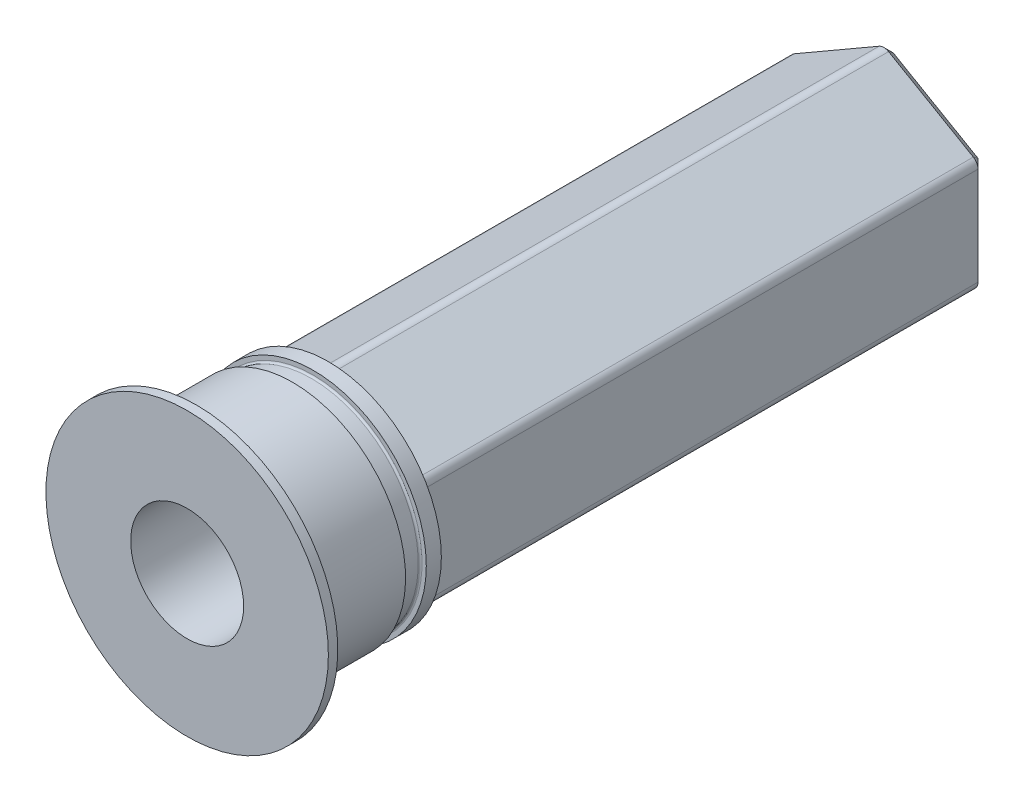
ISO-10303-21;
HEADER;
FILE_DESCRIPTION(('STEP AP214'),'2;1');
FILE_NAME('part.step','',(''),(''),'','','');
FILE_SCHEMA(('AUTOMOTIVE_DESIGN { 1 0 10303 214 1 1 1 1 }'));
ENDSEC;
DATA;
#1=APPLICATION_CONTEXT('core data for automotive mechanical design processes');
#2=APPLICATION_PROTOCOL_DEFINITION('international standard','automotive_design',2000,#1);
#3=PRODUCT_CONTEXT('',#1,'mechanical');
#4=PRODUCT('Part','Part','',(#3));
#5=PRODUCT_RELATED_PRODUCT_CATEGORY('part','',(#4));
#6=PRODUCT_DEFINITION_FORMATION('','',#4);
#7=PRODUCT_DEFINITION_CONTEXT('part definition',#1,'design');
#8=PRODUCT_DEFINITION('design','',#6,#7);
#9=PRODUCT_DEFINITION_SHAPE('','',#8);
#10=(LENGTH_UNIT() NAMED_UNIT(*) SI_UNIT(.MILLI.,.METRE.));
#11=(NAMED_UNIT(*) PLANE_ANGLE_UNIT() SI_UNIT($,.RADIAN.));
#12=(NAMED_UNIT(*) SI_UNIT($,.STERADIAN.) SOLID_ANGLE_UNIT());
#13=UNCERTAINTY_MEASURE_WITH_UNIT(LENGTH_MEASURE(1.E-05),#10,'distance_accuracy_value','');
#14=(GEOMETRIC_REPRESENTATION_CONTEXT(3) GLOBAL_UNCERTAINTY_ASSIGNED_CONTEXT((#13)) GLOBAL_UNIT_ASSIGNED_CONTEXT((#10,
#11,#12)) REPRESENTATION_CONTEXT('',''));
#15=CARTESIAN_POINT('',(0.,0.,0.));
#16=DIRECTION('',(0.,0.,1.));
#17=DIRECTION('',(1.,0.,0.));
#18=AXIS2_PLACEMENT_3D('',#15,#16,#17);
#19=CARTESIAN_POINT('',(0.,0.,-46.5));
#20=DIRECTION('',(0.,0.,1.));
#21=DIRECTION('',(1.,0.,0.));
#22=AXIS2_PLACEMENT_3D('',#19,#20,#21);
#23=CYLINDRICAL_SURFACE('',#22,3.);
#24=CARTESIAN_POINT('',(0.,0.,-46.5));
#25=DIRECTION('',(0.,0.,1.));
#26=DIRECTION('',(1.,0.,0.));
#27=AXIS2_PLACEMENT_3D('',#24,#25,#26);
#28=CIRCLE('',#27,3.);
#29=CARTESIAN_POINT('',(3.,0.,-46.5));
#30=VERTEX_POINT('',#29);
#31=EDGE_CURVE('E158',#30,#30,#28,.T.);
#32=CARTESIAN_POINT('',(0.,0.,-9.));
#33=DIRECTION('',(0.,0.,1.));
#34=DIRECTION('',(1.,0.,0.));
#35=AXIS2_PLACEMENT_3D('',#32,#33,#34);
#36=CIRCLE('',#35,3.);
#37=CARTESIAN_POINT('',(3.,0.,-9.));
#38=VERTEX_POINT('',#37);
#39=EDGE_CURVE('E497',#38,#38,#36,.F.);
#40=CARTESIAN_POINT('',(3.,0.,-46.5));
#41=CARTESIAN_POINT('',(3.,0.,-46.109375));
#42=CARTESIAN_POINT('',(3.,0.,-45.71875));
#43=CARTESIAN_POINT('',(3.,0.,-44.9375));
#44=CARTESIAN_POINT('',(3.,0.,-44.546875));
#45=CARTESIAN_POINT('',(3.,0.,-43.765625));
#46=CARTESIAN_POINT('',(3.,0.,-43.375));
#47=CARTESIAN_POINT('',(3.,0.,-42.59375));
#48=CARTESIAN_POINT('',(3.,0.,-42.203125));
#49=CARTESIAN_POINT('',(3.,0.,-41.421875));
#50=CARTESIAN_POINT('',(3.,0.,-41.03125));
#51=CARTESIAN_POINT('',(3.,0.,-40.25));
#52=CARTESIAN_POINT('',(3.,0.,-39.859375));
#53=CARTESIAN_POINT('',(3.,0.,-39.078125));
#54=CARTESIAN_POINT('',(3.,0.,-38.6875));
#55=CARTESIAN_POINT('',(3.,0.,-37.90625));
#56=CARTESIAN_POINT('',(3.,0.,-37.515625));
#57=CARTESIAN_POINT('',(3.,0.,-36.734375));
#58=CARTESIAN_POINT('',(3.,0.,-36.34375));
#59=CARTESIAN_POINT('',(3.,0.,-35.5625));
#60=CARTESIAN_POINT('',(3.,0.,-35.171875));
#61=CARTESIAN_POINT('',(3.,0.,-34.390625));
#62=CARTESIAN_POINT('',(3.,0.,-34.));
#63=CARTESIAN_POINT('',(3.,0.,-33.21875));
#64=CARTESIAN_POINT('',(3.,0.,-32.828125));
#65=CARTESIAN_POINT('',(3.,0.,-32.046875));
#66=CARTESIAN_POINT('',(3.,0.,-31.65625));
#67=CARTESIAN_POINT('',(3.,0.,-30.875));
#68=CARTESIAN_POINT('',(3.,0.,-30.484375));
#69=CARTESIAN_POINT('',(3.,0.,-29.703125));
#70=CARTESIAN_POINT('',(3.,0.,-29.3125));
#71=CARTESIAN_POINT('',(3.,0.,-28.53125));
#72=CARTESIAN_POINT('',(3.,0.,-28.140625));
#73=CARTESIAN_POINT('',(3.,0.,-27.359375));
#74=CARTESIAN_POINT('',(3.,0.,-26.96875));
#75=CARTESIAN_POINT('',(3.,0.,-26.1875));
#76=CARTESIAN_POINT('',(3.,0.,-25.796875));
#77=CARTESIAN_POINT('',(3.,0.,-25.015625));
#78=CARTESIAN_POINT('',(3.,0.,-24.625));
#79=CARTESIAN_POINT('',(3.,0.,-23.84375));
#80=CARTESIAN_POINT('',(3.,0.,-23.453125));
#81=CARTESIAN_POINT('',(3.,0.,-22.671875));
#82=CARTESIAN_POINT('',(3.,0.,-22.28125));
#83=CARTESIAN_POINT('',(3.,0.,-21.5));
#84=CARTESIAN_POINT('',(3.,0.,-21.109375));
#85=CARTESIAN_POINT('',(3.,0.,-20.328125));
#86=CARTESIAN_POINT('',(3.,0.,-19.9375));
#87=CARTESIAN_POINT('',(3.,0.,-19.15625));
#88=CARTESIAN_POINT('',(3.,0.,-18.765625));
#89=CARTESIAN_POINT('',(3.,0.,-17.984375));
#90=CARTESIAN_POINT('',(3.,0.,-17.59375));
#91=CARTESIAN_POINT('',(3.,0.,-16.8125));
#92=CARTESIAN_POINT('',(3.,0.,-16.421875));
#93=CARTESIAN_POINT('',(3.,0.,-15.640625));
#94=CARTESIAN_POINT('',(3.,0.,-15.25));
#95=CARTESIAN_POINT('',(3.,0.,-14.46875));
#96=CARTESIAN_POINT('',(3.,0.,-14.078125));
#97=CARTESIAN_POINT('',(3.,0.,-13.296875));
#98=CARTESIAN_POINT('',(3.,0.,-12.90625));
#99=CARTESIAN_POINT('',(3.,0.,-12.125));
#100=CARTESIAN_POINT('',(3.,0.,-11.734375));
#101=CARTESIAN_POINT('',(3.,0.,-10.953125));
#102=CARTESIAN_POINT('',(3.,0.,-10.5625));
#103=CARTESIAN_POINT('',(3.,0.,-9.78125));
#104=CARTESIAN_POINT('',(3.,0.,-9.390625));
#105=CARTESIAN_POINT('',(3.,0.,-9.));
#106=B_SPLINE_CURVE_WITH_KNOTS('',3,(#40,#41,#42,#43,#44,#45,#46,#47,#48,#49,#50,#51,#52,#53,
#54,#55,#56,#57,#58,#59,#60,#61,#62,#63,#64,#65,#66,#67,#68,#69,#70,#71,#72,#73,#74,#75,#76,#77,
#78,#79,#80,#81,#82,#83,#84,#85,#86,#87,#88,#89,#90,#91,#92,#93,#94,#95,#96,#97,#98,#99,#100,
#101,#102,#103,#104,#105),.UNSPECIFIED.,.F.,.F.,(4,2,2,2,2,2,2,2,2,2,2,2,2,2,2,2,2,2,2,2,2,2,2,
2,2,2,2,2,2,2,2,2,4),(0.,1.171875,2.34375,3.51562499999999,4.6875,5.859375,7.03125,8.203125,
9.37499999999999,10.546875,11.71875,12.890625,14.0625,15.234375,16.40625,17.578125,18.75,
19.921875,21.09375,22.265625,23.4375,24.609375,25.78125,26.953125,28.125,29.296875,30.46875,
31.640625,32.8125,33.984375,35.15625,36.328125,37.5),.UNSPECIFIED.);
#107=EDGE_CURVE('BSEAM42',#30,#38,#106,.T.);
#108=ORIENTED_EDGE('',*,*,#31,.F.);
#109=ORIENTED_EDGE('',*,*,#39,.F.);
#110=ORIENTED_EDGE('',*,*,#107,.T.);
#111=ORIENTED_EDGE('',*,*,#107,.F.);
#112=EDGE_LOOP('',(#108,#110,#109,#111));
#113=FACE_BOUND('',#112,.T.);
#114=ADVANCED_FACE('F42',(#113),#23,.F.);
#115=CARTESIAN_POINT('',(0.,0.,-8.5));
#116=DIRECTION('',(0.,0.,-1.));
#117=DIRECTION('',(0.,1.,0.));
#118=AXIS2_PLACEMENT_3D('',#115,#116,#117);
#119=CYLINDRICAL_SURFACE('',#118,7.5);
#120=CARTESIAN_POINT('',(0.,0.,-9.5));
#121=DIRECTION('',(0.,0.,-1.));
#122=DIRECTION('',(0.,1.,0.));
#123=AXIS2_PLACEMENT_3D('',#120,#121,#122);
#124=CIRCLE('',#123,7.5);
#125=CARTESIAN_POINT('',(0.,7.5,-9.5));
#126=VERTEX_POINT('',#125);
#127=EDGE_CURVE('E424',#126,#126,#124,.T.);
#128=ORIENTED_EDGE('',*,*,#127,.F.);
#129=EDGE_LOOP('',(#128));
#130=FACE_BOUND('',#129,.T.);
#131=CARTESIAN_POINT('',(0.,0.,-9.));
#132=DIRECTION('',(0.,0.,1.));
#133=DIRECTION('',(1.,0.,0.));
#134=AXIS2_PLACEMENT_3D('',#131,#132,#133);
#135=CIRCLE('',#134,7.5);
#136=CARTESIAN_POINT('',(7.5,0.,-9.));
#137=VERTEX_POINT('',#136);
#138=EDGE_CURVE('E46',#137,#137,#135,.F.);
#139=ORIENTED_EDGE('',*,*,#138,.T.);
#140=EDGE_LOOP('',(#139));
#141=FACE_BOUND('',#140,.T.);
#142=ADVANCED_FACE('F281',(#130,#141),#119,.T.);
#143=CARTESIAN_POINT('',(0.,0.,21.198484809835));
#144=DIRECTION('',(0.,0.,-1.));
#145=DIRECTION('',(0.,1.,0.));
#146=AXIS2_PLACEMENT_3D('',#143,#144,#145);
#147=CYLINDRICAL_SURFACE('',#146,6.);
#148=CARTESIAN_POINT('',(0.,0.,-9.8));
#149=DIRECTION('',(0.,0.,1.));
#150=DIRECTION('',(1.,0.,0.));
#151=AXIS2_PLACEMENT_3D('',#148,#149,#150);
#152=CIRCLE('',#151,6.);
#153=CARTESIAN_POINT('',(6.,0.,-9.8));
#154=VERTEX_POINT('',#153);
#155=EDGE_CURVE('E51',#154,#154,#152,.F.);
#156=ORIENTED_EDGE('',*,*,#155,.T.);
#157=EDGE_LOOP('',(#156));
#158=FACE_BOUND('',#157,.T.);
#159=CARTESIAN_POINT('',(0.,0.,-14.6));
#160=DIRECTION('',(0.,0.,-1.));
#161=DIRECTION('',(0.,1.,0.));
#162=AXIS2_PLACEMENT_3D('',#159,#160,#161);
#163=CIRCLE('',#162,6.);
#164=CARTESIAN_POINT('',(0.,6.,-14.6));
#165=VERTEX_POINT('',#164);
#166=EDGE_CURVE('E221',#165,#165,#163,.F.);
#167=ORIENTED_EDGE('',*,*,#166,.T.);
#168=EDGE_LOOP('',(#167));
#169=FACE_BOUND('',#168,.T.);
#170=ADVANCED_FACE('F263',(#158,#169),#147,.T.);
#171=CARTESIAN_POINT('',(0.,0.,-16.5));
#172=DIRECTION('',(0.,0.,1.));
#173=DIRECTION('',(1.,0.,0.));
#174=AXIS2_PLACEMENT_3D('',#171,#172,#173);
#175=CIRCLE('',#174,6.);
#176=CARTESIAN_POINT('',(6.,0.,-16.5));
#177=VERTEX_POINT('',#176);
#178=EDGE_CURVE('E418',#177,#177,#175,.F.);
#179=ORIENTED_EDGE('',*,*,#178,.F.);
#180=EDGE_LOOP('',(#179));
#181=FACE_BOUND('',#180,.T.);
#182=CARTESIAN_POINT('',(0.,0.,-15.7));
#183=DIRECTION('',(0.,0.,1.));
#184=DIRECTION('',(0.,-1.,0.));
#185=AXIS2_PLACEMENT_3D('',#182,#183,#184);
#186=CIRCLE('',#185,6.);
#187=CARTESIAN_POINT('',(0.,-6.,-15.7));
#188=VERTEX_POINT('',#187);
#189=EDGE_CURVE('E254',#188,#188,#186,.F.);
#190=ORIENTED_EDGE('',*,*,#189,.T.);
#191=EDGE_LOOP('',(#190));
#192=FACE_BOUND('',#191,.T.);
#193=ADVANCED_FACE('F298',(#181,#192),#147,.T.);
#194=CARTESIAN_POINT('',(0.,0.,-46.5));
#195=DIRECTION('',(0.,0.,1.));
#196=DIRECTION('',(1.,0.,0.));
#197=AXIS2_PLACEMENT_3D('',#194,#195,#196);
#198=PLANE('',#197);
#199=DIRECTION('',(-0.866025403784439,0.5,0.));
#200=VECTOR('',#199,1.);
#201=CARTESIAN_POINT('',(-4.50000000000001,-2.59807621135333,-46.5));
#202=LINE('',#201,#200);
#203=CARTESIAN_POINT('',(0.,-5.19615242270664,-46.5));
#204=VERTEX_POINT('',#203);
#205=CARTESIAN_POINT('',(-4.50000000000001,-2.59807621135333,-46.5));
#206=VERTEX_POINT('',#205);
#207=EDGE_CURVE('E176',#204,#206,#202,.T.);
#208=ORIENTED_EDGE('',*,*,#207,.T.);
#209=DIRECTION('',(0.,1.,0.));
#210=VECTOR('',#209,1.);
#211=CARTESIAN_POINT('',(-4.5,2.59807621135332,-46.5));
#212=LINE('',#211,#210);
#213=CARTESIAN_POINT('',(-4.5,2.59807621135331,-46.5));
#214=VERTEX_POINT('',#213);
#215=EDGE_CURVE('E192',#206,#214,#212,.T.);
#216=ORIENTED_EDGE('',*,*,#215,.T.);
#217=DIRECTION('',(0.866025403784439,0.5,0.));
#218=VECTOR('',#217,1.);
#219=CARTESIAN_POINT('',(0.,5.19615242270663,-46.5));
#220=LINE('',#219,#218);
#221=CARTESIAN_POINT('',(0.,5.19615242270662,-46.5));
#222=VERTEX_POINT('',#221);
#223=EDGE_CURVE('E190',#214,#222,#220,.T.);
#224=ORIENTED_EDGE('',*,*,#223,.T.);
#225=DIRECTION('',(0.866025403784439,-0.5,0.));
#226=VECTOR('',#225,1.);
#227=CARTESIAN_POINT('',(4.49999999999999,2.59807621135331,-46.5));
#228=LINE('',#227,#226);
#229=CARTESIAN_POINT('',(4.5,2.59807621135332,-46.5));
#230=VERTEX_POINT('',#229);
#231=EDGE_CURVE('E188',#222,#230,#228,.T.);
#232=ORIENTED_EDGE('',*,*,#231,.T.);
#233=DIRECTION('',(0.,-1.,0.));
#234=VECTOR('',#233,1.);
#235=CARTESIAN_POINT('',(4.5,-2.59807621135332,-46.5));
#236=LINE('',#235,#234);
#237=CARTESIAN_POINT('',(4.5,-2.59807621135331,-46.5));
#238=VERTEX_POINT('',#237);
#239=EDGE_CURVE('E186',#230,#238,#236,.T.);
#240=ORIENTED_EDGE('',*,*,#239,.T.);
#241=DIRECTION('',(-0.866025403784439,-0.5,0.));
#242=VECTOR('',#241,1.);
#243=CARTESIAN_POINT('',(0.,-5.19615242270663,-46.5));
#244=LINE('',#243,#242);
#245=EDGE_CURVE('E179',#238,#204,#244,.T.);
#246=ORIENTED_EDGE('',*,*,#245,.T.);
#247=EDGE_LOOP('',(#208,#216,#224,#232,#240,#246));
#248=FACE_BOUND('',#247,.T.);
#249=ORIENTED_EDGE('',*,*,#31,.T.);
#250=EDGE_LOOP('',(#249));
#251=FACE_BOUND('',#250,.T.);
#252=ADVANCED_FACE('F295',(#248,#251),#198,.F.);
#253=CARTESIAN_POINT('',(0.,0.,-9.5));
#254=DIRECTION('',(0.,0.,1.));
#255=DIRECTION('',(1.,0.,0.));
#256=AXIS2_PLACEMENT_3D('',#253,#254,#255);
#257=PLANE('',#256);
#258=CARTESIAN_POINT('',(0.,0.,-9.5));
#259=DIRECTION('',(0.,0.,1.));
#260=DIRECTION('',(1.,0.,0.));
#261=AXIS2_PLACEMENT_3D('',#258,#259,#260);
#262=CIRCLE('',#261,6.3);
#263=CARTESIAN_POINT('',(6.3,0.,-9.5));
#264=VERTEX_POINT('',#263);
#265=EDGE_CURVE('E13',#264,#264,#262,.T.);
#266=ORIENTED_EDGE('',*,*,#265,.T.);
#267=EDGE_LOOP('',(#266));
#268=FACE_BOUND('',#267,.T.);
#269=ORIENTED_EDGE('',*,*,#127,.T.);
#270=EDGE_LOOP('',(#269));
#271=FACE_BOUND('',#270,.T.);
#272=ADVANCED_FACE('F293',(#268,#271),#257,.F.);
#273=CARTESIAN_POINT('',(5.,-2.88675134594812,22.5141171956319));
#274=DIRECTION('',(0.5,-0.866025403784439,0.));
#275=DIRECTION('',(0.866025403784439,0.5,0.));
#276=AXIS2_PLACEMENT_3D('',#273,#274,#275);
#277=PLANE('',#276);
#278=DIRECTION('',(0.,0.,-1.));
#279=VECTOR('',#278,1.);
#280=CARTESIAN_POINT('',(0.25,-5.62916512459885,22.5141171956319));
#281=LINE('',#280,#279);
#282=CARTESIAN_POINT('',(0.249999999999999,-5.62916512459885,-16.5));
#283=VERTEX_POINT('',#282);
#284=CARTESIAN_POINT('',(0.25,-5.62916512459885,-46.));
#285=VERTEX_POINT('',#284);
#286=EDGE_CURVE('E175',#283,#285,#281,.T.);
#287=ORIENTED_EDGE('',*,*,#286,.T.);
#288=DIRECTION('',(0.866025403784439,0.5,0.));
#289=VECTOR('',#288,1.);
#290=CARTESIAN_POINT('',(4.75,-3.03108891324554,-46.));
#291=LINE('',#290,#289);
#292=CARTESIAN_POINT('',(4.75,-3.03108891324554,-46.));
#293=VERTEX_POINT('',#292);
#294=EDGE_CURVE('E204',#285,#293,#291,.T.);
#295=ORIENTED_EDGE('',*,*,#294,.T.);
#296=DIRECTION('',(0.,0.,-1.));
#297=VECTOR('',#296,1.);
#298=CARTESIAN_POINT('',(4.75,-3.03108891324553,22.5141171956319));
#299=LINE('',#298,#297);
#300=CARTESIAN_POINT('',(4.75,-3.03108891324553,-16.5));
#301=VERTEX_POINT('',#300);
#302=EDGE_CURVE('E402',#293,#301,#299,.F.);
#303=ORIENTED_EDGE('',*,*,#302,.T.);
#304=DIRECTION('',(-0.866025403784439,-0.5,0.));
#305=VECTOR('',#304,1.);
#306=CARTESIAN_POINT('',(5.,-2.88675134594813,-16.5));
#307=LINE('',#306,#305);
#308=EDGE_CURVE('E170',#301,#283,#307,.T.);
#309=ORIENTED_EDGE('',*,*,#308,.T.);
#310=EDGE_LOOP('',(#287,#295,#303,#309));
#311=FACE_BOUND('',#310,.T.);
#312=ADVANCED_FACE('F463',(#311),#277,.T.);
#313=CARTESIAN_POINT('',(5.,2.88675134594813,22.5141171956319));
#314=DIRECTION('',(1.,0.,0.));
#315=DIRECTION('',(0.,1.,0.));
#316=AXIS2_PLACEMENT_3D('',#313,#314,#315);
#317=PLANE('',#316);
#318=DIRECTION('',(0.,0.,-1.));
#319=VECTOR('',#318,1.);
#320=CARTESIAN_POINT('',(5.,-2.59807621135331,22.5141171956319));
#321=LINE('',#320,#319);
#322=CARTESIAN_POINT('',(5.,-2.59807621135331,-16.5));
#323=VERTEX_POINT('',#322);
#324=CARTESIAN_POINT('',(5.,-2.59807621135332,-46.));
#325=VERTEX_POINT('',#324);
#326=EDGE_CURVE('E392',#323,#325,#321,.T.);
#327=ORIENTED_EDGE('',*,*,#326,.T.);
#328=DIRECTION('',(0.,1.,0.));
#329=VECTOR('',#328,1.);
#330=CARTESIAN_POINT('',(5.,2.59807621135332,-46.));
#331=LINE('',#330,#329);
#332=CARTESIAN_POINT('',(5.,2.59807621135332,-46.));
#333=VERTEX_POINT('',#332);
#334=EDGE_CURVE('E202',#325,#333,#331,.T.);
#335=ORIENTED_EDGE('',*,*,#334,.T.);
#336=DIRECTION('',(0.,0.,-1.));
#337=VECTOR('',#336,1.);
#338=CARTESIAN_POINT('',(5.,2.59807621135332,22.5141171956319));
#339=LINE('',#338,#337);
#340=CARTESIAN_POINT('',(5.,2.59807621135332,-16.5));
#341=VERTEX_POINT('',#340);
#342=EDGE_CURVE('E382',#333,#341,#339,.F.);
#343=ORIENTED_EDGE('',*,*,#342,.T.);
#344=DIRECTION('',(0.,-1.,0.));
#345=VECTOR('',#344,1.);
#346=CARTESIAN_POINT('',(5.,2.88675134594813,-16.5));
#347=LINE('',#346,#345);
#348=EDGE_CURVE('E253',#341,#323,#347,.T.);
#349=ORIENTED_EDGE('',*,*,#348,.T.);
#350=EDGE_LOOP('',(#327,#335,#343,#349));
#351=FACE_BOUND('',#350,.T.);
#352=ADVANCED_FACE('F468',(#351),#317,.T.);
#353=CARTESIAN_POINT('',(0.,5.77350269189626,22.5141171956319));
#354=DIRECTION('',(0.5,0.866025403784439,0.));
#355=DIRECTION('',(-0.866025403784439,0.5,0.));
#356=AXIS2_PLACEMENT_3D('',#353,#354,#355);
#357=PLANE('',#356);
#358=DIRECTION('',(0.,0.,-1.));
#359=VECTOR('',#358,1.);
#360=CARTESIAN_POINT('',(4.75,3.03108891324554,22.5141171956319));
#361=LINE('',#360,#359);
#362=CARTESIAN_POINT('',(4.75,3.03108891324554,-16.5));
#363=VERTEX_POINT('',#362);
#364=CARTESIAN_POINT('',(4.75,3.03108891324554,-46.));
#365=VERTEX_POINT('',#364);
#366=EDGE_CURVE('E381',#363,#365,#361,.T.);
#367=ORIENTED_EDGE('',*,*,#366,.T.);
#368=DIRECTION('',(-0.866025403784439,0.5,0.));
#369=VECTOR('',#368,1.);
#370=CARTESIAN_POINT('',(0.250000000000001,5.62916512459885,-46.));
#371=LINE('',#370,#369);
#372=CARTESIAN_POINT('',(0.250000000000001,5.62916512459885,-46.));
#373=VERTEX_POINT('',#372);
#374=EDGE_CURVE('E200',#365,#373,#371,.T.);
#375=ORIENTED_EDGE('',*,*,#374,.T.);
#376=DIRECTION('',(0.,0.,-1.));
#377=VECTOR('',#376,1.);
#378=CARTESIAN_POINT('',(0.250000000000001,5.62916512459886,22.5141171956319));
#379=LINE('',#378,#377);
#380=CARTESIAN_POINT('',(0.250000000000001,5.62916512459885,-16.5));
#381=VERTEX_POINT('',#380);
#382=EDGE_CURVE('E389',#373,#381,#379,.F.);
#383=ORIENTED_EDGE('',*,*,#382,.T.);
#384=DIRECTION('',(0.866025403784439,-0.5,0.));
#385=VECTOR('',#384,1.);
#386=CARTESIAN_POINT('',(0.,5.77350269189626,-16.5));
#387=LINE('',#386,#385);
#388=EDGE_CURVE('E388',#381,#363,#387,.T.);
#389=ORIENTED_EDGE('',*,*,#388,.T.);
#390=EDGE_LOOP('',(#367,#375,#383,#389));
#391=FACE_BOUND('',#390,.T.);
#392=ADVANCED_FACE('F385',(#391),#357,.T.);
#393=CARTESIAN_POINT('',(-5.,2.88675134594813,22.5141171956319));
#394=DIRECTION('',(-0.5,0.866025403784439,0.));
#395=DIRECTION('',(-0.866025403784438,-0.5,0.));
#396=AXIS2_PLACEMENT_3D('',#393,#394,#395);
#397=PLANE('',#396);
#398=DIRECTION('',(0.,0.,-1.));
#399=VECTOR('',#398,1.);
#400=CARTESIAN_POINT('',(-0.249999999999999,5.62916512459886,22.5141171956319));
#401=LINE('',#400,#399);
#402=CARTESIAN_POINT('',(-0.250000000000001,5.62916512459885,-16.5));
#403=VERTEX_POINT('',#402);
#404=CARTESIAN_POINT('',(-0.249999999999999,5.62916512459885,-46.));
#405=VERTEX_POINT('',#404);
#406=EDGE_CURVE('E394',#403,#405,#401,.T.);
#407=ORIENTED_EDGE('',*,*,#406,.T.);
#408=DIRECTION('',(-0.866025403784438,-0.5,0.));
#409=VECTOR('',#408,1.);
#410=CARTESIAN_POINT('',(-4.75,3.03108891324553,-46.));
#411=LINE('',#410,#409);
#412=CARTESIAN_POINT('',(-4.75,3.03108891324553,-46.));
#413=VERTEX_POINT('',#412);
#414=EDGE_CURVE('E198',#405,#413,#411,.T.);
#415=ORIENTED_EDGE('',*,*,#414,.T.);
#416=DIRECTION('',(0.,0.,-1.));
#417=VECTOR('',#416,1.);
#418=CARTESIAN_POINT('',(-4.75,3.03108891324554,22.5141171956319));
#419=LINE('',#418,#417);
#420=CARTESIAN_POINT('',(-4.75,3.03108891324554,-16.5));
#421=VERTEX_POINT('',#420);
#422=EDGE_CURVE('E390',#413,#421,#419,.F.);
#423=ORIENTED_EDGE('',*,*,#422,.T.);
#424=DIRECTION('',(0.866025403784438,0.5,0.));
#425=VECTOR('',#424,1.);
#426=CARTESIAN_POINT('',(-5.,2.88675134594813,-16.5));
#427=LINE('',#426,#425);
#428=EDGE_CURVE('E419',#421,#403,#427,.T.);
#429=ORIENTED_EDGE('',*,*,#428,.T.);
#430=EDGE_LOOP('',(#407,#415,#423,#429));
#431=FACE_BOUND('',#430,.T.);
#432=ADVANCED_FACE('F440',(#431),#397,.T.);
#433=CARTESIAN_POINT('',(-5.,-2.88675134594812,22.5141171956319));
#434=DIRECTION('',(-1.,0.,0.));
#435=DIRECTION('',(0.,0.,1.));
#436=AXIS2_PLACEMENT_3D('',#433,#434,#435);
#437=PLANE('',#436);
#438=DIRECTION('',(0.,0.,-1.));
#439=VECTOR('',#438,1.);
#440=CARTESIAN_POINT('',(-5.,2.59807621135332,22.5141171956319));
#441=LINE('',#440,#439);
#442=CARTESIAN_POINT('',(-5.,2.59807621135332,-16.5));
#443=VERTEX_POINT('',#442);
#444=CARTESIAN_POINT('',(-5.,2.59807621135332,-46.));
#445=VERTEX_POINT('',#444);
#446=EDGE_CURVE('E432',#443,#445,#441,.T.);
#447=ORIENTED_EDGE('',*,*,#446,.T.);
#448=DIRECTION('',(0.,-1.,0.));
#449=VECTOR('',#448,1.);
#450=CARTESIAN_POINT('',(-5.,-2.59807621135332,-46.));
#451=LINE('',#450,#449);
#452=CARTESIAN_POINT('',(-5.,-2.59807621135332,-46.));
#453=VERTEX_POINT('',#452);
#454=EDGE_CURVE('E195',#445,#453,#451,.T.);
#455=ORIENTED_EDGE('',*,*,#454,.T.);
#456=DIRECTION('',(0.,0.,-1.));
#457=VECTOR('',#456,1.);
#458=CARTESIAN_POINT('',(-5.,-2.59807621135331,22.5141171956319));
#459=LINE('',#458,#457);
#460=CARTESIAN_POINT('',(-5.,-2.59807621135331,-16.5));
#461=VERTEX_POINT('',#460);
#462=EDGE_CURVE('E435',#453,#461,#459,.F.);
#463=ORIENTED_EDGE('',*,*,#462,.T.);
#464=DIRECTION('',(0.,1.,0.));
#465=VECTOR('',#464,1.);
#466=CARTESIAN_POINT('',(-5.,-2.88675134594812,-16.5));
#467=LINE('',#466,#465);
#468=EDGE_CURVE('E169',#461,#443,#467,.T.);
#469=ORIENTED_EDGE('',*,*,#468,.T.);
#470=EDGE_LOOP('',(#447,#455,#463,#469));
#471=FACE_BOUND('',#470,.T.);
#472=ADVANCED_FACE('F454',(#471),#437,.T.);
#473=CARTESIAN_POINT('',(0.,-5.77350269189625,22.5141171956319));
#474=DIRECTION('',(-0.5,-0.866025403784439,0.));
#475=DIRECTION('',(0.866025403784438,-0.5,0.));
#476=AXIS2_PLACEMENT_3D('',#473,#474,#475);
#477=PLANE('',#476);
#478=DIRECTION('',(0.,0.,-1.));
#479=VECTOR('',#478,1.);
#480=CARTESIAN_POINT('',(-4.75,-3.03108891324553,22.5141171956319));
#481=LINE('',#480,#479);
#482=CARTESIAN_POINT('',(-4.75,-3.03108891324553,-16.5));
#483=VERTEX_POINT('',#482);
#484=CARTESIAN_POINT('',(-4.75,-3.03108891324553,-46.));
#485=VERTEX_POINT('',#484);
#486=EDGE_CURVE('E157',#483,#485,#481,.T.);
#487=ORIENTED_EDGE('',*,*,#486,.T.);
#488=DIRECTION('',(0.866025403784438,-0.5,0.));
#489=VECTOR('',#488,1.);
#490=CARTESIAN_POINT('',(-0.25,-5.62916512459885,-46.));
#491=LINE('',#490,#489);
#492=CARTESIAN_POINT('',(-0.25,-5.62916512459885,-46.));
#493=VERTEX_POINT('',#492);
#494=EDGE_CURVE('E65',#485,#493,#491,.T.);
#495=ORIENTED_EDGE('',*,*,#494,.T.);
#496=DIRECTION('',(0.,0.,-1.));
#497=VECTOR('',#496,1.);
#498=CARTESIAN_POINT('',(-0.25,-5.62916512459885,22.5141171956319));
#499=LINE('',#498,#497);
#500=CARTESIAN_POINT('',(-0.25,-5.62916512459885,-16.5));
#501=VERTEX_POINT('',#500);
#502=EDGE_CURVE('E150',#493,#501,#499,.F.);
#503=ORIENTED_EDGE('',*,*,#502,.T.);
#504=DIRECTION('',(-0.866025403784438,0.5,0.));
#505=VECTOR('',#504,1.);
#506=CARTESIAN_POINT('',(0.,-5.77350269189626,-16.5));
#507=LINE('',#506,#505);
#508=EDGE_CURVE('E153',#501,#483,#507,.T.);
#509=ORIENTED_EDGE('',*,*,#508,.T.);
#510=EDGE_LOOP('',(#487,#495,#503,#509));
#511=FACE_BOUND('',#510,.T.);
#512=ADVANCED_FACE('F152',(#511),#477,.T.);
#513=CARTESIAN_POINT('',(0.,0.,-16.5));
#514=DIRECTION('',(0.,0.,1.));
#515=DIRECTION('',(1.,0.,0.));
#516=AXIS2_PLACEMENT_3D('',#513,#514,#515);
#517=PLANE('',#516);
#518=ORIENTED_EDGE('',*,*,#178,.T.);
#519=EDGE_LOOP('',(#518));
#520=FACE_BOUND('',#519,.T.);
#521=ORIENTED_EDGE('',*,*,#348,.F.);
#522=CARTESIAN_POINT('',(4.5,2.59807621135332,-16.5));
#523=DIRECTION('',(0.,0.,1.));
#524=DIRECTION('',(1.,0.,0.));
#525=AXIS2_PLACEMENT_3D('',#522,#523,#524);
#526=CIRCLE('',#525,0.5);
#527=EDGE_CURVE('E181',#341,#363,#526,.T.);
#528=ORIENTED_EDGE('',*,*,#527,.T.);
#529=ORIENTED_EDGE('',*,*,#388,.F.);
#530=CARTESIAN_POINT('',(0.,5.19615242270663,-16.5));
#531=DIRECTION('',(0.,0.,1.));
#532=DIRECTION('',(1.,0.,0.));
#533=AXIS2_PLACEMENT_3D('',#530,#531,#532);
#534=CIRCLE('',#533,0.5);
#535=EDGE_CURVE('E407',#381,#403,#534,.T.);
#536=ORIENTED_EDGE('',*,*,#535,.T.);
#537=ORIENTED_EDGE('',*,*,#428,.F.);
#538=CARTESIAN_POINT('',(-4.5,2.59807621135332,-16.5));
#539=DIRECTION('',(0.,0.,1.));
#540=DIRECTION('',(1.,0.,0.));
#541=AXIS2_PLACEMENT_3D('',#538,#539,#540);
#542=CIRCLE('',#541,0.5);
#543=EDGE_CURVE('E405',#421,#443,#542,.T.);
#544=ORIENTED_EDGE('',*,*,#543,.T.);
#545=ORIENTED_EDGE('',*,*,#468,.F.);
#546=CARTESIAN_POINT('',(-4.5,-2.59807621135331,-16.5));
#547=DIRECTION('',(0.,0.,1.));
#548=DIRECTION('',(1.,0.,0.));
#549=AXIS2_PLACEMENT_3D('',#546,#547,#548);
#550=CIRCLE('',#549,0.5);
#551=EDGE_CURVE('E168',#461,#483,#550,.T.);
#552=ORIENTED_EDGE('',*,*,#551,.T.);
#553=ORIENTED_EDGE('',*,*,#508,.F.);
#554=CARTESIAN_POINT('',(0.,-5.19615242270663,-16.5));
#555=DIRECTION('',(0.,0.,1.));
#556=DIRECTION('',(1.,0.,0.));
#557=AXIS2_PLACEMENT_3D('',#554,#555,#556);
#558=CIRCLE('',#557,0.5);
#559=EDGE_CURVE('E164',#501,#283,#558,.T.);
#560=ORIENTED_EDGE('',*,*,#559,.T.);
#561=ORIENTED_EDGE('',*,*,#308,.F.);
#562=CARTESIAN_POINT('',(4.5,-2.59807621135331,-16.5));
#563=DIRECTION('',(0.,0.,1.));
#564=DIRECTION('',(1.,0.,0.));
#565=AXIS2_PLACEMENT_3D('',#562,#563,#564);
#566=CIRCLE('',#565,0.5);
#567=EDGE_CURVE('E177',#301,#323,#566,.T.);
#568=ORIENTED_EDGE('',*,*,#567,.T.);
#569=EDGE_LOOP('',(#521,#528,#529,#536,#537,#544,#545,#552,#553,#560,#561,#568));
#570=FACE_BOUND('',#569,.T.);
#571=ADVANCED_FACE('F162',(#520,#570),#517,.F.);
#572=CARTESIAN_POINT('',(-4.5,-2.59807621135331,22.5141171956319));
#573=DIRECTION('',(0.,0.,-1.));
#574=DIRECTION('',(0.,1.,0.));
#575=AXIS2_PLACEMENT_3D('',#572,#573,#574);
#576=CYLINDRICAL_SURFACE('',#575,0.5);
#577=ORIENTED_EDGE('',*,*,#462,.F.);
#578=CARTESIAN_POINT('',(-4.5,-2.59807621135332,-46.));
#579=DIRECTION('',(0.,0.,1.));
#580=DIRECTION('',(1.,0.,0.));
#581=AXIS2_PLACEMENT_3D('',#578,#579,#580);
#582=CIRCLE('',#581,0.5);
#583=EDGE_CURVE('E58',#453,#485,#582,.T.);
#584=ORIENTED_EDGE('',*,*,#583,.T.);
#585=ORIENTED_EDGE('',*,*,#486,.F.);
#586=ORIENTED_EDGE('',*,*,#551,.F.);
#587=EDGE_LOOP('',(#577,#584,#585,#586));
#588=FACE_BOUND('',#587,.T.);
#589=ADVANCED_FACE('F300',(#588),#576,.T.);
#590=CARTESIAN_POINT('',(-4.5,2.59807621135332,22.5141171956319));
#591=DIRECTION('',(0.,0.,-1.));
#592=DIRECTION('',(0.,1.,0.));
#593=AXIS2_PLACEMENT_3D('',#590,#591,#592);
#594=CYLINDRICAL_SURFACE('',#593,0.5);
#595=ORIENTED_EDGE('',*,*,#422,.F.);
#596=CARTESIAN_POINT('',(-4.5,2.59807621135332,-46.));
#597=DIRECTION('',(0.,0.,1.));
#598=DIRECTION('',(1.,0.,0.));
#599=AXIS2_PLACEMENT_3D('',#596,#597,#598);
#600=CIRCLE('',#599,0.5);
#601=EDGE_CURVE('E212',#413,#445,#600,.T.);
#602=ORIENTED_EDGE('',*,*,#601,.T.);
#603=ORIENTED_EDGE('',*,*,#446,.F.);
#604=ORIENTED_EDGE('',*,*,#543,.F.);
#605=EDGE_LOOP('',(#595,#602,#603,#604));
#606=FACE_BOUND('',#605,.T.);
#607=ADVANCED_FACE('F303',(#606),#594,.T.);
#608=CARTESIAN_POINT('',(0.,5.19615242270664,22.5141171956319));
#609=DIRECTION('',(0.,0.,-1.));
#610=DIRECTION('',(0.,1.,0.));
#611=AXIS2_PLACEMENT_3D('',#608,#609,#610);
#612=CYLINDRICAL_SURFACE('',#611,0.5);
#613=ORIENTED_EDGE('',*,*,#382,.F.);
#614=CARTESIAN_POINT('',(0.,5.19615242270663,-46.));
#615=DIRECTION('',(0.,0.,1.));
#616=DIRECTION('',(1.,0.,0.));
#617=AXIS2_PLACEMENT_3D('',#614,#615,#616);
#618=CIRCLE('',#617,0.5);
#619=EDGE_CURVE('E208',#373,#405,#618,.T.);
#620=ORIENTED_EDGE('',*,*,#619,.T.);
#621=ORIENTED_EDGE('',*,*,#406,.F.);
#622=ORIENTED_EDGE('',*,*,#535,.F.);
#623=EDGE_LOOP('',(#613,#620,#621,#622));
#624=FACE_BOUND('',#623,.T.);
#625=ADVANCED_FACE('F306',(#624),#612,.T.);
#626=CARTESIAN_POINT('',(4.5,2.59807621135332,22.5141171956319));
#627=DIRECTION('',(0.,0.,-1.));
#628=DIRECTION('',(0.,1.,0.));
#629=AXIS2_PLACEMENT_3D('',#626,#627,#628);
#630=CYLINDRICAL_SURFACE('',#629,0.5);
#631=ORIENTED_EDGE('',*,*,#342,.F.);
#632=CARTESIAN_POINT('',(4.5,2.59807621135332,-46.));
#633=DIRECTION('',(0.,0.,1.));
#634=DIRECTION('',(1.,0.,0.));
#635=AXIS2_PLACEMENT_3D('',#632,#633,#634);
#636=CIRCLE('',#635,0.5);
#637=EDGE_CURVE('E206',#333,#365,#636,.T.);
#638=ORIENTED_EDGE('',*,*,#637,.T.);
#639=ORIENTED_EDGE('',*,*,#366,.F.);
#640=ORIENTED_EDGE('',*,*,#527,.F.);
#641=EDGE_LOOP('',(#631,#638,#639,#640));
#642=FACE_BOUND('',#641,.T.);
#643=ADVANCED_FACE('F310',(#642),#630,.T.);
#644=CARTESIAN_POINT('',(4.5,-2.59807621135331,22.5141171956319));
#645=DIRECTION('',(0.,0.,-1.));
#646=DIRECTION('',(0.,1.,0.));
#647=AXIS2_PLACEMENT_3D('',#644,#645,#646);
#648=CYLINDRICAL_SURFACE('',#647,0.5);
#649=ORIENTED_EDGE('',*,*,#302,.F.);
#650=CARTESIAN_POINT('',(4.5,-2.59807621135332,-46.));
#651=DIRECTION('',(0.,0.,1.));
#652=DIRECTION('',(1.,0.,0.));
#653=AXIS2_PLACEMENT_3D('',#650,#651,#652);
#654=CIRCLE('',#653,0.5);
#655=EDGE_CURVE('E210',#293,#325,#654,.T.);
#656=ORIENTED_EDGE('',*,*,#655,.T.);
#657=ORIENTED_EDGE('',*,*,#326,.F.);
#658=ORIENTED_EDGE('',*,*,#567,.F.);
#659=EDGE_LOOP('',(#649,#656,#657,#658));
#660=FACE_BOUND('',#659,.T.);
#661=ADVANCED_FACE('F314',(#660),#648,.T.);
#662=CARTESIAN_POINT('',(0.,-5.19615242270663,22.5141171956319));
#663=DIRECTION('',(0.,0.,-1.));
#664=DIRECTION('',(0.,1.,0.));
#665=AXIS2_PLACEMENT_3D('',#662,#663,#664);
#666=CYLINDRICAL_SURFACE('',#665,0.5);
#667=ORIENTED_EDGE('',*,*,#502,.F.);
#668=CARTESIAN_POINT('',(0.,-5.19615242270663,-46.));
#669=DIRECTION('',(0.,0.,1.));
#670=DIRECTION('',(1.,0.,0.));
#671=AXIS2_PLACEMENT_3D('',#668,#669,#670);
#672=CIRCLE('',#671,0.5);
#673=EDGE_CURVE('E214',#493,#285,#672,.T.);
#674=ORIENTED_EDGE('',*,*,#673,.T.);
#675=ORIENTED_EDGE('',*,*,#286,.F.);
#676=ORIENTED_EDGE('',*,*,#559,.F.);
#677=EDGE_LOOP('',(#667,#674,#675,#676));
#678=FACE_BOUND('',#677,.T.);
#679=ADVANCED_FACE('F173',(#678),#666,.T.);
#680=CARTESIAN_POINT('',(4.5,0.,-46.5));
#681=DIRECTION('',(0.707106781186548,0.,-0.707106781186547));
#682=DIRECTION('',(-0.707106781186547,0.,-0.707106781186548));
#683=AXIS2_PLACEMENT_3D('',#680,#681,#682);
#684=PLANE('',#683);
#685=DIRECTION('',(-0.707106781186547,0.,-0.707106781186547));
#686=VECTOR('',#685,1.);
#687=CARTESIAN_POINT('',(5.,2.59807621135332,-46.));
#688=LINE('',#687,#686);
#689=EDGE_CURVE('E247',#333,#230,#688,.T.);
#690=ORIENTED_EDGE('',*,*,#689,.F.);
#691=ORIENTED_EDGE('',*,*,#334,.F.);
#692=DIRECTION('',(0.707106781186547,0.,0.707106781186547));
#693=VECTOR('',#692,1.);
#694=CARTESIAN_POINT('',(4.5,-2.59807621135332,-46.5));
#695=LINE('',#694,#693);
#696=EDGE_CURVE('E250',#238,#325,#695,.T.);
#697=ORIENTED_EDGE('',*,*,#696,.F.);
#698=ORIENTED_EDGE('',*,*,#239,.F.);
#699=EDGE_LOOP('',(#690,#691,#697,#698));
#700=FACE_BOUND('',#699,.T.);
#701=ADVANCED_FACE('F321',(#700),#684,.T.);
#702=CARTESIAN_POINT('',(4.5,-2.59807621135332,-46.));
#703=DIRECTION('',(0.,0.,1.));
#704=DIRECTION('',(1.,0.,0.));
#705=AXIS2_PLACEMENT_3D('',#702,#703,#704);
#706=CONICAL_SURFACE('',#705,0.499999999999986,0.785398163397434);
#707=ORIENTED_EDGE('',*,*,#696,.T.);
#708=ORIENTED_EDGE('',*,*,#655,.F.);
#709=DIRECTION('',(0.353553390593274,-0.612372435695795,0.707106781186546));
#710=VECTOR('',#709,1.);
#711=CARTESIAN_POINT('',(4.5,-2.59807621135331,-46.5));
#712=LINE('',#711,#710);
#713=EDGE_CURVE('E244',#238,#293,#712,.T.);
#714=ORIENTED_EDGE('',*,*,#713,.F.);
#715=EDGE_LOOP('',(#707,#708,#714));
#716=FACE_BOUND('',#715,.T.);
#717=ADVANCED_FACE('F362',(#716),#706,.T.);
#718=CARTESIAN_POINT('',(4.5,2.59807621135332,-46.));
#719=DIRECTION('',(0.,0.,1.));
#720=DIRECTION('',(1.,0.,0.));
#721=AXIS2_PLACEMENT_3D('',#718,#719,#720);
#722=CONICAL_SURFACE('',#721,0.499999999999986,0.785398163397434);
#723=ORIENTED_EDGE('',*,*,#637,.F.);
#724=ORIENTED_EDGE('',*,*,#689,.T.);
#725=DIRECTION('',(-0.353553390593278,-0.6123724356958,-0.707106781186541));
#726=VECTOR('',#725,1.);
#727=CARTESIAN_POINT('',(4.75,3.03108891324554,-46.));
#728=LINE('',#727,#726);
#729=EDGE_CURVE('E241',#365,#230,#728,.T.);
#730=ORIENTED_EDGE('',*,*,#729,.F.);
#731=EDGE_LOOP('',(#723,#724,#730));
#732=FACE_BOUND('',#731,.T.);
#733=ADVANCED_FACE('F358',(#732),#722,.T.);
#734=CARTESIAN_POINT('',(2.25,-3.89711431702997,-46.5));
#735=DIRECTION('',(0.353553390593273,-0.612372435695794,-0.707106781186548));
#736=DIRECTION('',(0.,0.755928946018455,-0.654653670707976));
#737=AXIS2_PLACEMENT_3D('',#734,#735,#736);
#738=PLANE('',#737);
#739=ORIENTED_EDGE('',*,*,#713,.T.);
#740=ORIENTED_EDGE('',*,*,#294,.F.);
#741=DIRECTION('',(0.353553390593274,-0.612372435695796,0.707106781186546));
#742=VECTOR('',#741,1.);
#743=CARTESIAN_POINT('',(0.,-5.19615242270663,-46.5));
#744=LINE('',#743,#742);
#745=EDGE_CURVE('E238',#204,#285,#744,.T.);
#746=ORIENTED_EDGE('',*,*,#745,.F.);
#747=ORIENTED_EDGE('',*,*,#245,.F.);
#748=EDGE_LOOP('',(#739,#740,#746,#747));
#749=FACE_BOUND('',#748,.T.);
#750=ADVANCED_FACE('F354',(#749),#738,.T.);
#751=CARTESIAN_POINT('',(2.25,3.89711431702997,-46.5));
#752=DIRECTION('',(0.35355339059327,0.612372435695789,-0.707106781186554));
#753=DIRECTION('',(0.,0.755928946018461,0.65465367070797));
#754=AXIS2_PLACEMENT_3D('',#751,#752,#753);
#755=PLANE('',#754);
#756=ORIENTED_EDGE('',*,*,#729,.T.);
#757=ORIENTED_EDGE('',*,*,#231,.F.);
#758=DIRECTION('',(-0.353553390593277,-0.612372435695801,-0.70710678118654));
#759=VECTOR('',#758,1.);
#760=CARTESIAN_POINT('',(0.250000000000001,5.62916512459885,-46.));
#761=LINE('',#760,#759);
#762=EDGE_CURVE('E235',#373,#222,#761,.T.);
#763=ORIENTED_EDGE('',*,*,#762,.F.);
#764=ORIENTED_EDGE('',*,*,#374,.F.);
#765=EDGE_LOOP('',(#756,#757,#763,#764));
#766=FACE_BOUND('',#765,.T.);
#767=ADVANCED_FACE('F350',(#766),#755,.T.);
#768=CARTESIAN_POINT('',(0.,-5.19615242270663,-46.));
#769=DIRECTION('',(0.,0.,1.));
#770=DIRECTION('',(1.,0.,0.));
#771=AXIS2_PLACEMENT_3D('',#768,#769,#770);
#772=CONICAL_SURFACE('',#771,0.499999999999986,0.785398163397434);
#773=ORIENTED_EDGE('',*,*,#745,.T.);
#774=ORIENTED_EDGE('',*,*,#673,.F.);
#775=DIRECTION('',(-0.353553390593268,-0.612372435695785,0.707106781186558));
#776=VECTOR('',#775,1.);
#777=CARTESIAN_POINT('',(0.,-5.19615242270664,-46.5));
#778=LINE('',#777,#776);
#779=EDGE_CURVE('E232',#204,#493,#778,.T.);
#780=ORIENTED_EDGE('',*,*,#779,.F.);
#781=EDGE_LOOP('',(#773,#774,#780));
#782=FACE_BOUND('',#781,.T.);
#783=ADVANCED_FACE('F346',(#782),#772,.T.);
#784=CARTESIAN_POINT('',(0.,5.19615242270663,-46.));
#785=DIRECTION('',(0.,0.,1.));
#786=DIRECTION('',(1.,0.,0.));
#787=AXIS2_PLACEMENT_3D('',#784,#785,#786);
#788=CONICAL_SURFACE('',#787,0.499999999999986,0.785398163397434);
#789=ORIENTED_EDGE('',*,*,#619,.F.);
#790=ORIENTED_EDGE('',*,*,#762,.T.);
#791=DIRECTION('',(0.353553390593275,-0.612372435695796,-0.707106781186545));
#792=VECTOR('',#791,1.);
#793=CARTESIAN_POINT('',(-0.249999999999999,5.62916512459885,-46.));
#794=LINE('',#793,#792);
#795=EDGE_CURVE('E229',#405,#222,#794,.T.);
#796=ORIENTED_EDGE('',*,*,#795,.F.);
#797=EDGE_LOOP('',(#789,#790,#796));
#798=FACE_BOUND('',#797,.T.);
#799=ADVANCED_FACE('F342',(#798),#788,.T.);
#800=CARTESIAN_POINT('',(-2.25000000000001,-3.89711431702998,-46.5));
#801=DIRECTION('',(-0.353553390593279,-0.612372435695803,-0.707106781186538));
#802=DIRECTION('',(0.,0.755928946018446,-0.654653670707987));
#803=AXIS2_PLACEMENT_3D('',#800,#801,#802);
#804=PLANE('',#803);
#805=ORIENTED_EDGE('',*,*,#779,.T.);
#806=ORIENTED_EDGE('',*,*,#494,.F.);
#807=DIRECTION('',(-0.353553390593269,-0.612372435695786,0.707106781186557));
#808=VECTOR('',#807,1.);
#809=CARTESIAN_POINT('',(-4.50000000000001,-2.59807621135333,-46.5));
#810=LINE('',#809,#808);
#811=EDGE_CURVE('E226',#206,#485,#810,.T.);
#812=ORIENTED_EDGE('',*,*,#811,.F.);
#813=ORIENTED_EDGE('',*,*,#207,.F.);
#814=EDGE_LOOP('',(#805,#806,#812,#813));
#815=FACE_BOUND('',#814,.T.);
#816=ADVANCED_FACE('F338',(#815),#804,.T.);
#817=CARTESIAN_POINT('',(-2.25,3.89711431702997,-46.5));
#818=DIRECTION('',(-0.353553390593273,0.612372435695792,-0.70710678118655));
#819=DIRECTION('',(0.,0.755928946018457,0.654653670707974));
#820=AXIS2_PLACEMENT_3D('',#817,#818,#819);
#821=PLANE('',#820);
#822=ORIENTED_EDGE('',*,*,#795,.T.);
#823=ORIENTED_EDGE('',*,*,#223,.F.);
#824=DIRECTION('',(0.353553390593275,-0.612372435695797,-0.707106781186545));
#825=VECTOR('',#824,1.);
#826=CARTESIAN_POINT('',(-4.75,3.03108891324553,-46.));
#827=LINE('',#826,#825);
#828=EDGE_CURVE('E223',#413,#214,#827,.T.);
#829=ORIENTED_EDGE('',*,*,#828,.F.);
#830=ORIENTED_EDGE('',*,*,#414,.F.);
#831=EDGE_LOOP('',(#822,#823,#829,#830));
#832=FACE_BOUND('',#831,.T.);
#833=ADVANCED_FACE('F334',(#832),#821,.T.);
#834=CARTESIAN_POINT('',(-4.5,-2.59807621135332,-46.));
#835=DIRECTION('',(0.,0.,1.));
#836=DIRECTION('',(1.,0.,0.));
#837=AXIS2_PLACEMENT_3D('',#834,#835,#836);
#838=CONICAL_SURFACE('',#837,0.499999999999986,0.785398163397434);
#839=ORIENTED_EDGE('',*,*,#811,.T.);
#840=ORIENTED_EDGE('',*,*,#583,.F.);
#841=DIRECTION('',(-0.707106781186547,0.,0.707106781186547));
#842=VECTOR('',#841,1.);
#843=CARTESIAN_POINT('',(-4.5,-2.59807621135332,-46.5));
#844=LINE('',#843,#842);
#845=EDGE_CURVE('E220',#206,#453,#844,.T.);
#846=ORIENTED_EDGE('',*,*,#845,.F.);
#847=EDGE_LOOP('',(#839,#840,#846));
#848=FACE_BOUND('',#847,.T.);
#849=ADVANCED_FACE('F330',(#848),#838,.T.);
#850=CARTESIAN_POINT('',(-4.5,2.59807621135332,-46.));
#851=DIRECTION('',(0.,0.,1.));
#852=DIRECTION('',(1.,0.,0.));
#853=AXIS2_PLACEMENT_3D('',#850,#851,#852);
#854=CONICAL_SURFACE('',#853,0.499999999999986,0.785398163397434);
#855=ORIENTED_EDGE('',*,*,#601,.F.);
#856=ORIENTED_EDGE('',*,*,#828,.T.);
#857=DIRECTION('',(0.707106781186547,0.,-0.707106781186547));
#858=VECTOR('',#857,1.);
#859=CARTESIAN_POINT('',(-5.,2.59807621135332,-46.));
#860=LINE('',#859,#858);
#861=EDGE_CURVE('E218',#445,#214,#860,.T.);
#862=ORIENTED_EDGE('',*,*,#861,.F.);
#863=EDGE_LOOP('',(#855,#856,#862));
#864=FACE_BOUND('',#863,.T.);
#865=ADVANCED_FACE('F326',(#864),#854,.T.);
#866=CARTESIAN_POINT('',(-4.5,0.,-46.5));
#867=DIRECTION('',(-0.707106781186547,0.,-0.707106781186547));
#868=DIRECTION('',(-0.707106781186548,0.,0.707106781186548));
#869=AXIS2_PLACEMENT_3D('',#866,#867,#868);
#870=PLANE('',#869);
#871=ORIENTED_EDGE('',*,*,#845,.T.);
#872=ORIENTED_EDGE('',*,*,#454,.F.);
#873=ORIENTED_EDGE('',*,*,#861,.T.);
#874=ORIENTED_EDGE('',*,*,#215,.F.);
#875=EDGE_LOOP('',(#871,#872,#873,#874));
#876=FACE_BOUND('',#875,.T.);
#877=ADVANCED_FACE('F322',(#876),#870,.T.);
#878=CARTESIAN_POINT('',(0.,5.775,-14.6));
#879=DIRECTION('',(0.,0.,-1.));
#880=DIRECTION('',(0.,1.,0.));
#881=AXIS2_PLACEMENT_3D('',#878,#879,#880);
#882=PLANE('',#881);
#883=ORIENTED_EDGE('',*,*,#166,.F.);
#884=EDGE_LOOP('',(#883));
#885=FACE_BOUND('',#884,.T.);
#886=CARTESIAN_POINT('',(0.,0.,-14.6));
#887=DIRECTION('',(0.,0.,-1.));
#888=DIRECTION('',(0.,1.,0.));
#889=AXIS2_PLACEMENT_3D('',#886,#887,#888);
#890=CIRCLE('',#889,5.775);
#891=CARTESIAN_POINT('',(0.,5.775,-14.6));
#892=VERTEX_POINT('',#891);
#893=EDGE_CURVE('E257',#892,#892,#890,.T.);
#894=ORIENTED_EDGE('',*,*,#893,.F.);
#895=EDGE_LOOP('',(#894));
#896=FACE_BOUND('',#895,.T.);
#897=ADVANCED_FACE('F325',(#885,#896),#882,.T.);
#898=CARTESIAN_POINT('',(0.,0.,-14.7));
#899=DIRECTION('',(0.,0.,-1.));
#900=DIRECTION('',(0.,1.,0.));
#901=AXIS2_PLACEMENT_3D('',#898,#899,#900);
#902=TOROIDAL_SURFACE('',#901,5.775,0.100000000000002);
#903=ORIENTED_EDGE('',*,*,#893,.T.);
#904=EDGE_LOOP('',(#903));
#905=FACE_BOUND('',#904,.T.);
#906=CARTESIAN_POINT('',(0.,0.,-14.7));
#907=DIRECTION('',(0.,0.,-1.));
#908=DIRECTION('',(0.,1.,0.));
#909=AXIS2_PLACEMENT_3D('',#906,#907,#908);
#910=CIRCLE('',#909,5.675);
#911=CARTESIAN_POINT('',(0.,5.675,-14.7));
#912=VERTEX_POINT('',#911);
#913=EDGE_CURVE('E500',#912,#912,#910,.T.);
#914=ORIENTED_EDGE('',*,*,#913,.F.);
#915=EDGE_LOOP('',(#914));
#916=FACE_BOUND('',#915,.T.);
#917=ADVANCED_FACE('F509',(#905,#916),#902,.F.);
#918=CARTESIAN_POINT('',(0.,0.,69.3591736633532));
#919=DIRECTION('',(0.,0.,-1.));
#920=DIRECTION('',(0.,1.,0.));
#921=AXIS2_PLACEMENT_3D('',#918,#919,#920);
#922=CYLINDRICAL_SURFACE('',#921,5.675);
#923=ORIENTED_EDGE('',*,*,#913,.T.);
#924=EDGE_LOOP('',(#923));
#925=FACE_BOUND('',#924,.T.);
#926=CARTESIAN_POINT('',(0.,0.,-15.6));
#927=DIRECTION('',(0.,0.,-1.));
#928=DIRECTION('',(0.,1.,0.));
#929=AXIS2_PLACEMENT_3D('',#926,#927,#928);
#930=CIRCLE('',#929,5.675);
#931=CARTESIAN_POINT('',(0.,5.675,-15.6));
#932=VERTEX_POINT('',#931);
#933=EDGE_CURVE('E496',#932,#932,#930,.T.);
#934=ORIENTED_EDGE('',*,*,#933,.F.);
#935=EDGE_LOOP('',(#934));
#936=FACE_BOUND('',#935,.T.);
#937=ADVANCED_FACE('F518',(#925,#936),#922,.T.);
#938=CARTESIAN_POINT('',(0.,0.,-15.6));
#939=DIRECTION('',(0.,0.,-1.));
#940=DIRECTION('',(0.,1.,0.));
#941=AXIS2_PLACEMENT_3D('',#938,#939,#940);
#942=TOROIDAL_SURFACE('',#941,5.775,0.0999999999999981);
#943=ORIENTED_EDGE('',*,*,#933,.T.);
#944=EDGE_LOOP('',(#943));
#945=FACE_BOUND('',#944,.T.);
#946=CARTESIAN_POINT('',(0.,0.,-15.7));
#947=DIRECTION('',(0.,0.,-1.));
#948=DIRECTION('',(0.,1.,0.));
#949=AXIS2_PLACEMENT_3D('',#946,#947,#948);
#950=CIRCLE('',#949,5.775);
#951=CARTESIAN_POINT('',(0.,5.775,-15.7));
#952=VERTEX_POINT('',#951);
#953=EDGE_CURVE('E494',#952,#952,#950,.T.);
#954=ORIENTED_EDGE('',*,*,#953,.F.);
#955=EDGE_LOOP('',(#954));
#956=FACE_BOUND('',#955,.T.);
#957=ADVANCED_FACE('F276',(#945,#956),#942,.F.);
#958=CARTESIAN_POINT('',(0.,7.275,-15.7));
#959=DIRECTION('',(0.,0.,1.));
#960=DIRECTION('',(0.,-1.,0.));
#961=AXIS2_PLACEMENT_3D('',#958,#959,#960);
#962=PLANE('',#961);
#963=ORIENTED_EDGE('',*,*,#189,.F.);
#964=EDGE_LOOP('',(#963));
#965=FACE_BOUND('',#964,.T.);
#966=ORIENTED_EDGE('',*,*,#953,.T.);
#967=EDGE_LOOP('',(#966));
#968=FACE_BOUND('',#967,.T.);
#969=ADVANCED_FACE('F268',(#965,#968),#962,.T.);
#970=CARTESIAN_POINT('',(0.,0.,-9.8));
#971=DIRECTION('',(0.,0.,1.));
#972=DIRECTION('',(1.,0.,0.));
#973=AXIS2_PLACEMENT_3D('',#970,#971,#972);
#974=TOROIDAL_SURFACE('',#973,6.3,0.3);
#975=ORIENTED_EDGE('',*,*,#265,.F.);
#976=EDGE_LOOP('',(#975));
#977=FACE_BOUND('',#976,.T.);
#978=ORIENTED_EDGE('',*,*,#155,.F.);
#979=EDGE_LOOP('',(#978));
#980=FACE_BOUND('',#979,.T.);
#981=ADVANCED_FACE('F44',(#977,#980),#974,.F.);
#982=CARTESIAN_POINT('',(0.,0.,-9.));
#983=DIRECTION('',(0.,0.,1.));
#984=DIRECTION('',(1.,0.,0.));
#985=AXIS2_PLACEMENT_3D('',#982,#983,#984);
#986=PLANE('',#985);
#987=ORIENTED_EDGE('',*,*,#138,.F.);
#988=EDGE_LOOP('',(#987));
#989=FACE_BOUND('',#988,.T.);
#990=ORIENTED_EDGE('',*,*,#39,.T.);
#991=EDGE_LOOP('',(#990));
#992=FACE_BOUND('',#991,.T.);
#993=ADVANCED_FACE('F267',(#989,#992),#986,.T.);
#994=CLOSED_SHELL('',(#114,#142,#170,#193,#252,#272,#312,#352,#392,#432,#472,#512,#571,#589,
#607,#625,#643,#661,#679,#701,#717,#733,#750,#767,#783,#799,#816,#833,#849,#865,#877,#897,#917,
#937,#957,#969,#981,#993));
#995=MANIFOLD_SOLID_BREP('B2',#994);
#996=ADVANCED_BREP_SHAPE_REPRESENTATION('',(#18,#995),#14);
#997=SHAPE_DEFINITION_REPRESENTATION(#9,#996);
ENDSEC;
END-ISO-10303-21;
